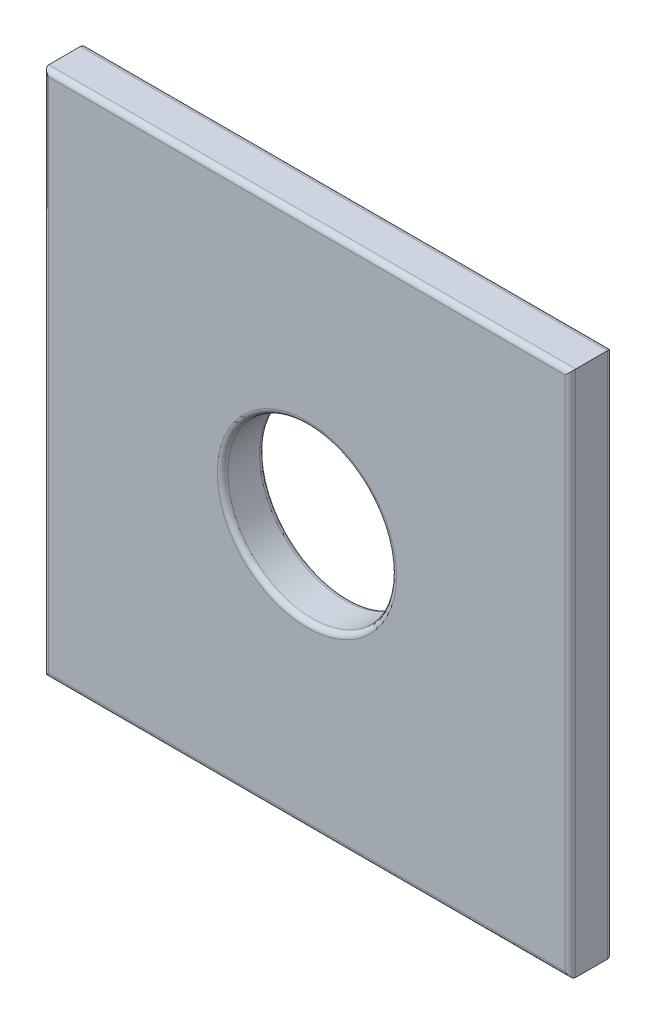
ISO-10303-21;
HEADER;
FILE_DESCRIPTION(('STEP AP214'),'2;1');
FILE_NAME('part.step','',(''),(''),'','','');
FILE_SCHEMA(('AUTOMOTIVE_DESIGN { 1 0 10303 214 1 1 1 1 }'));
ENDSEC;
DATA;
#1=APPLICATION_CONTEXT('core data for automotive mechanical design processes');
#2=APPLICATION_PROTOCOL_DEFINITION('international standard','automotive_design',2000,#1);
#3=PRODUCT_CONTEXT('',#1,'mechanical');
#4=PRODUCT('Part','Part','',(#3));
#5=PRODUCT_RELATED_PRODUCT_CATEGORY('part','',(#4));
#6=PRODUCT_DEFINITION_FORMATION('','',#4);
#7=PRODUCT_DEFINITION_CONTEXT('part definition',#1,'design');
#8=PRODUCT_DEFINITION('design','',#6,#7);
#9=PRODUCT_DEFINITION_SHAPE('','',#8);
#10=(LENGTH_UNIT() NAMED_UNIT(*) SI_UNIT(.MILLI.,.METRE.));
#11=(NAMED_UNIT(*) PLANE_ANGLE_UNIT() SI_UNIT($,.RADIAN.));
#12=(NAMED_UNIT(*) SI_UNIT($,.STERADIAN.) SOLID_ANGLE_UNIT());
#13=UNCERTAINTY_MEASURE_WITH_UNIT(LENGTH_MEASURE(1.E-05),#10,'distance_accuracy_value','');
#14=(GEOMETRIC_REPRESENTATION_CONTEXT(3) GLOBAL_UNCERTAINTY_ASSIGNED_CONTEXT((#13)) GLOBAL_UNIT_ASSIGNED_CONTEXT((#10,
#11,#12)) REPRESENTATION_CONTEXT('',''));
#15=CARTESIAN_POINT('',(0.,0.,0.));
#16=DIRECTION('',(0.,0.,1.));
#17=DIRECTION('',(1.,0.,0.));
#18=AXIS2_PLACEMENT_3D('',#15,#16,#17);
#19=CARTESIAN_POINT('',(-1005.55579576106,0.,4.));
#20=DIRECTION('',(1.,0.,0.));
#21=DIRECTION('',(0.,0.,-1.));
#22=AXIS2_PLACEMENT_3D('',#19,#20,#21);
#23=PLANE('',#22);
#24=DIRECTION('',(0.,0.,-1.));
#25=VECTOR('',#24,1.);
#26=CARTESIAN_POINT('',(-1005.55579576106,-175.582176963622,4.));
#27=LINE('',#26,#25);
#28=CARTESIAN_POINT('',(-1005.55579576106,-175.582176963622,3.5));
#29=VERTEX_POINT('',#28);
#30=CARTESIAN_POINT('',(-1005.55579576106,-175.582176963622,0.5));
#31=VERTEX_POINT('',#30);
#32=EDGE_CURVE('E154',#29,#31,#27,.T.);
#33=ORIENTED_EDGE('',*,*,#32,.T.);
#34=DIRECTION('',(0.,-1.,0.));
#35=VECTOR('',#34,1.);
#36=CARTESIAN_POINT('',(-1005.55579576106,-125.582176963622,0.5));
#37=LINE('',#36,#35);
#38=CARTESIAN_POINT('',(-1005.55579576106,-125.582176963622,0.5));
#39=VERTEX_POINT('',#38);
#40=EDGE_CURVE('E174',#31,#39,#37,.F.);
#41=ORIENTED_EDGE('',*,*,#40,.T.);
#42=DIRECTION('',(0.,0.,-1.));
#43=VECTOR('',#42,1.);
#44=CARTESIAN_POINT('',(-1005.55579576106,-125.582176963622,4.));
#45=LINE('',#44,#43);
#46=CARTESIAN_POINT('',(-1005.55579576106,-125.582176963622,3.5));
#47=VERTEX_POINT('',#46);
#48=EDGE_CURVE('E135',#47,#39,#45,.T.);
#49=ORIENTED_EDGE('',*,*,#48,.F.);
#50=DIRECTION('',(0.,-1.,0.));
#51=VECTOR('',#50,1.);
#52=CARTESIAN_POINT('',(-1005.55579576106,0.,3.5));
#53=LINE('',#52,#51);
#54=EDGE_CURVE('E176',#47,#29,#53,.T.);
#55=ORIENTED_EDGE('',*,*,#54,.T.);
#56=EDGE_LOOP('',(#33,#41,#49,#55));
#57=FACE_BOUND('',#56,.T.);
#58=ADVANCED_FACE('F47',(#57),#23,.T.);
#59=CARTESIAN_POINT('',(0.,-125.582176963622,4.));
#60=DIRECTION('',(0.,-1.,0.));
#61=DIRECTION('',(0.,0.,-1.));
#62=AXIS2_PLACEMENT_3D('',#59,#60,#61);
#63=PLANE('',#62);
#64=ORIENTED_EDGE('',*,*,#48,.T.);
#65=DIRECTION('',(-1.,0.,0.));
#66=VECTOR('',#65,1.);
#67=CARTESIAN_POINT('',(0.,-125.582176963622,0.5));
#68=LINE('',#67,#66);
#69=CARTESIAN_POINT('',(-1055.55579576106,-125.582176963622,0.5));
#70=VERTEX_POINT('',#69);
#71=EDGE_CURVE('E134',#39,#70,#68,.T.);
#72=ORIENTED_EDGE('',*,*,#71,.T.);
#73=DIRECTION('',(0.,0.,-1.));
#74=VECTOR('',#73,1.);
#75=CARTESIAN_POINT('',(-1055.55579576106,-125.582176963622,4.));
#76=LINE('',#75,#74);
#77=CARTESIAN_POINT('',(-1055.55579576106,-125.582176963622,3.5));
#78=VERTEX_POINT('',#77);
#79=EDGE_CURVE('E116',#78,#70,#76,.T.);
#80=ORIENTED_EDGE('',*,*,#79,.F.);
#81=DIRECTION('',(-1.,0.,0.));
#82=VECTOR('',#81,1.);
#83=CARTESIAN_POINT('',(-1005.55579576106,-125.582176963622,3.5));
#84=LINE('',#83,#82);
#85=EDGE_CURVE('E131',#78,#47,#84,.F.);
#86=ORIENTED_EDGE('',*,*,#85,.T.);
#87=EDGE_LOOP('',(#64,#72,#80,#86));
#88=FACE_BOUND('',#87,.T.);
#89=ADVANCED_FACE('F130',(#88),#63,.F.);
#90=CARTESIAN_POINT('',(-1055.55579576106,0.,4.));
#91=DIRECTION('',(1.,0.,0.));
#92=DIRECTION('',(0.,0.,-1.));
#93=AXIS2_PLACEMENT_3D('',#90,#91,#92);
#94=PLANE('',#93);
#95=ORIENTED_EDGE('',*,*,#79,.T.);
#96=DIRECTION('',(0.,-1.,0.));
#97=VECTOR('',#96,1.);
#98=CARTESIAN_POINT('',(-1055.55579576106,0.,0.5));
#99=LINE('',#98,#97);
#100=CARTESIAN_POINT('',(-1055.55579576106,-175.582176963622,0.5));
#101=VERTEX_POINT('',#100);
#102=EDGE_CURVE('E123',#70,#101,#99,.T.);
#103=ORIENTED_EDGE('',*,*,#102,.T.);
#104=DIRECTION('',(0.,0.,-1.));
#105=VECTOR('',#104,1.);
#106=CARTESIAN_POINT('',(-1055.55579576106,-175.582176963622,4.));
#107=LINE('',#106,#105);
#108=CARTESIAN_POINT('',(-1055.55579576106,-175.582176963622,3.5));
#109=VERTEX_POINT('',#108);
#110=EDGE_CURVE('E118',#109,#101,#107,.T.);
#111=ORIENTED_EDGE('',*,*,#110,.F.);
#112=DIRECTION('',(0.,-1.,0.));
#113=VECTOR('',#112,1.);
#114=CARTESIAN_POINT('',(-1055.55579576106,-125.582176963622,3.5));
#115=LINE('',#114,#113);
#116=EDGE_CURVE('E113',#109,#78,#115,.F.);
#117=ORIENTED_EDGE('',*,*,#116,.T.);
#118=EDGE_LOOP('',(#95,#103,#111,#117));
#119=FACE_BOUND('',#118,.T.);
#120=ADVANCED_FACE('F115',(#119),#94,.F.);
#121=CARTESIAN_POINT('',(-1030.55579576106,-150.582176963622,4.));
#122=DIRECTION('',(0.,0.,-1.));
#123=DIRECTION('',(-1.,0.,0.));
#124=AXIS2_PLACEMENT_3D('',#121,#122,#123);
#125=CYLINDRICAL_SURFACE('',#124,7.99999999999999);
#126=CARTESIAN_POINT('',(-1030.55579576106,-150.582176963622,0.5));
#127=DIRECTION('',(0.,0.,1.));
#128=DIRECTION('',(1.,0.,0.));
#129=AXIS2_PLACEMENT_3D('',#126,#127,#128);
#130=CIRCLE('',#129,7.99999999999999);
#131=CARTESIAN_POINT('',(-1022.55579576106,-150.582176963622,0.5));
#132=VERTEX_POINT('',#131);
#133=EDGE_CURVE('E168',#132,#132,#130,.F.);
#134=ORIENTED_EDGE('',*,*,#133,.T.);
#135=EDGE_LOOP('',(#134));
#136=FACE_BOUND('',#135,.T.);
#137=CARTESIAN_POINT('',(-1030.55579576106,-150.582176963622,3.5));
#138=DIRECTION('',(0.,0.,1.));
#139=DIRECTION('',(1.,0.,0.));
#140=AXIS2_PLACEMENT_3D('',#137,#138,#139);
#141=CIRCLE('',#140,7.99999999999999);
#142=CARTESIAN_POINT('',(-1022.55579576106,-150.582176963622,3.5));
#143=VERTEX_POINT('',#142);
#144=EDGE_CURVE('E171',#143,#143,#141,.T.);
#145=ORIENTED_EDGE('',*,*,#144,.T.);
#146=EDGE_LOOP('',(#145));
#147=FACE_BOUND('',#146,.T.);
#148=ADVANCED_FACE('F246',(#136,#147),#125,.F.);
#149=CARTESIAN_POINT('',(0.,-175.582176963622,4.));
#150=DIRECTION('',(0.,-1.,0.));
#151=DIRECTION('',(0.,0.,-1.));
#152=AXIS2_PLACEMENT_3D('',#149,#150,#151);
#153=PLANE('',#152);
#154=ORIENTED_EDGE('',*,*,#110,.T.);
#155=DIRECTION('',(-1.,0.,0.));
#156=VECTOR('',#155,1.);
#157=CARTESIAN_POINT('',(-1005.55579576106,-175.582176963622,0.5));
#158=LINE('',#157,#156);
#159=EDGE_CURVE('E178',#101,#31,#158,.F.);
#160=ORIENTED_EDGE('',*,*,#159,.T.);
#161=ORIENTED_EDGE('',*,*,#32,.F.);
#162=DIRECTION('',(-1.,0.,0.));
#163=VECTOR('',#162,1.);
#164=CARTESIAN_POINT('',(0.,-175.582176963622,3.5));
#165=LINE('',#164,#163);
#166=EDGE_CURVE('E180',#29,#109,#165,.T.);
#167=ORIENTED_EDGE('',*,*,#166,.T.);
#168=EDGE_LOOP('',(#154,#160,#161,#167));
#169=FACE_BOUND('',#168,.T.);
#170=ADVANCED_FACE('F221',(#169),#153,.T.);
#171=CARTESIAN_POINT('',(0.,0.,4.));
#172=DIRECTION('',(0.,0.,1.));
#173=DIRECTION('',(1.,0.,0.));
#174=AXIS2_PLACEMENT_3D('',#171,#172,#173);
#175=PLANE('',#174);
#176=DIRECTION('',(0.,-1.,0.));
#177=VECTOR('',#176,1.);
#178=CARTESIAN_POINT('',(-1055.05579576106,-175.582176963622,4.));
#179=LINE('',#178,#177);
#180=CARTESIAN_POINT('',(-1055.05579576106,-126.082176963622,4.));
#181=VERTEX_POINT('',#180);
#182=CARTESIAN_POINT('',(-1055.05579576106,-175.082176963622,4.));
#183=VERTEX_POINT('',#182);
#184=EDGE_CURVE('E56',#181,#183,#179,.T.);
#185=ORIENTED_EDGE('',*,*,#184,.T.);
#186=DIRECTION('',(-1.,0.,0.));
#187=VECTOR('',#186,1.);
#188=CARTESIAN_POINT('',(0.,-175.082176963622,4.));
#189=LINE('',#188,#187);
#190=CARTESIAN_POINT('',(-1006.05579576106,-175.082176963622,4.));
#191=VERTEX_POINT('',#190);
#192=EDGE_CURVE('E13',#183,#191,#189,.F.);
#193=ORIENTED_EDGE('',*,*,#192,.T.);
#194=DIRECTION('',(0.,-1.,0.));
#195=VECTOR('',#194,1.);
#196=CARTESIAN_POINT('',(-1006.05579576106,0.,4.));
#197=LINE('',#196,#195);
#198=CARTESIAN_POINT('',(-1006.05579576106,-126.082176963622,4.));
#199=VERTEX_POINT('',#198);
#200=EDGE_CURVE('E163',#191,#199,#197,.F.);
#201=ORIENTED_EDGE('',*,*,#200,.T.);
#202=DIRECTION('',(-1.,0.,0.));
#203=VECTOR('',#202,1.);
#204=CARTESIAN_POINT('',(-1055.55579576106,-126.082176963622,4.));
#205=LINE('',#204,#203);
#206=EDGE_CURVE('E67',#199,#181,#205,.T.);
#207=ORIENTED_EDGE('',*,*,#206,.T.);
#208=EDGE_LOOP('',(#185,#193,#201,#207));
#209=FACE_BOUND('',#208,.T.);
#210=CARTESIAN_POINT('',(-1030.55579576106,-150.582176963622,4.));
#211=DIRECTION('',(0.,0.,1.));
#212=DIRECTION('',(1.,0.,0.));
#213=AXIS2_PLACEMENT_3D('',#210,#211,#212);
#214=CIRCLE('',#213,8.49999999999999);
#215=CARTESIAN_POINT('',(-1022.05579576106,-150.582176963622,4.));
#216=VERTEX_POINT('',#215);
#217=EDGE_CURVE('E165',#216,#216,#214,.F.);
#218=ORIENTED_EDGE('',*,*,#217,.T.);
#219=EDGE_LOOP('',(#218));
#220=FACE_BOUND('',#219,.T.);
#221=ADVANCED_FACE('F226',(#209,#220),#175,.T.);
#222=CARTESIAN_POINT('',(0.,0.,0.));
#223=DIRECTION('',(0.,0.,1.));
#224=DIRECTION('',(1.,0.,0.));
#225=AXIS2_PLACEMENT_3D('',#222,#223,#224);
#226=PLANE('',#225);
#227=DIRECTION('',(0.,-1.,0.));
#228=VECTOR('',#227,1.);
#229=CARTESIAN_POINT('',(-1055.05579576106,0.,0.));
#230=LINE('',#229,#228);
#231=CARTESIAN_POINT('',(-1055.05579576106,-175.082176963622,0.));
#232=VERTEX_POINT('',#231);
#233=CARTESIAN_POINT('',(-1055.05579576106,-126.082176963622,0.));
#234=VERTEX_POINT('',#233);
#235=EDGE_CURVE('E185',#232,#234,#230,.F.);
#236=ORIENTED_EDGE('',*,*,#235,.T.);
#237=DIRECTION('',(-1.,0.,0.));
#238=VECTOR('',#237,1.);
#239=CARTESIAN_POINT('',(0.,-126.082176963622,0.));
#240=LINE('',#239,#238);
#241=CARTESIAN_POINT('',(-1006.05579576106,-126.082176963622,0.));
#242=VERTEX_POINT('',#241);
#243=EDGE_CURVE('E124',#234,#242,#240,.F.);
#244=ORIENTED_EDGE('',*,*,#243,.T.);
#245=DIRECTION('',(0.,-1.,0.));
#246=VECTOR('',#245,1.);
#247=CARTESIAN_POINT('',(-1006.05579576106,-175.582176963622,0.));
#248=LINE('',#247,#246);
#249=CARTESIAN_POINT('',(-1006.05579576106,-175.082176963622,0.));
#250=VERTEX_POINT('',#249);
#251=EDGE_CURVE('E189',#242,#250,#248,.T.);
#252=ORIENTED_EDGE('',*,*,#251,.T.);
#253=DIRECTION('',(-1.,0.,0.));
#254=VECTOR('',#253,1.);
#255=CARTESIAN_POINT('',(-1055.55579576106,-175.082176963622,0.));
#256=LINE('',#255,#254);
#257=EDGE_CURVE('E187',#250,#232,#256,.T.);
#258=ORIENTED_EDGE('',*,*,#257,.T.);
#259=EDGE_LOOP('',(#236,#244,#252,#258));
#260=FACE_BOUND('',#259,.T.);
#261=CARTESIAN_POINT('',(-1030.55579576106,-150.582176963622,0.));
#262=DIRECTION('',(0.,0.,1.));
#263=DIRECTION('',(1.,0.,0.));
#264=AXIS2_PLACEMENT_3D('',#261,#262,#263);
#265=CIRCLE('',#264,8.49999999999999);
#266=CARTESIAN_POINT('',(-1022.05579576106,-150.582176963622,0.));
#267=VERTEX_POINT('',#266);
#268=EDGE_CURVE('E191',#267,#267,#265,.T.);
#269=ORIENTED_EDGE('',*,*,#268,.T.);
#270=EDGE_LOOP('',(#269));
#271=FACE_BOUND('',#270,.T.);
#272=ADVANCED_FACE('F258',(#260,#271),#226,.F.);
#273=CARTESIAN_POINT('',(0.,-175.082176963622,0.5));
#274=DIRECTION('',(1.,0.,0.));
#275=DIRECTION('',(0.,0.,-1.));
#276=AXIS2_PLACEMENT_3D('',#273,#274,#275);
#277=CYLINDRICAL_SURFACE('',#276,0.5);
#278=CARTESIAN_POINT('',(-1055.05579576106,-175.082176963622,0.5));
#279=DIRECTION('',(0.707106781186547,-0.707106781186547,0.));
#280=DIRECTION('',(0.707106781186547,0.707106781186547,0.));
#281=AXIS2_PLACEMENT_3D('',#278,#279,#280);
#282=ELLIPSE('',#281,0.707106781186547,0.5);
#283=EDGE_CURVE('E155',#232,#101,#282,.F.);
#284=ORIENTED_EDGE('',*,*,#283,.F.);
#285=ORIENTED_EDGE('',*,*,#257,.F.);
#286=CARTESIAN_POINT('',(-1006.05579576106,-175.082176963622,0.5));
#287=DIRECTION('',(0.707106781186547,0.707106781186547,0.));
#288=DIRECTION('',(-0.707106781186547,0.707106781186547,0.));
#289=AXIS2_PLACEMENT_3D('',#286,#287,#288);
#290=ELLIPSE('',#289,0.707106781186547,0.5);
#291=EDGE_CURVE('E151',#31,#250,#290,.T.);
#292=ORIENTED_EDGE('',*,*,#291,.F.);
#293=ORIENTED_EDGE('',*,*,#159,.F.);
#294=EDGE_LOOP('',(#284,#285,#292,#293));
#295=FACE_BOUND('',#294,.T.);
#296=ADVANCED_FACE('F208',(#295),#277,.T.);
#297=CARTESIAN_POINT('',(-1006.05579576106,0.,0.5));
#298=DIRECTION('',(0.,1.,0.));
#299=DIRECTION('',(0.,0.,1.));
#300=AXIS2_PLACEMENT_3D('',#297,#298,#299);
#301=CYLINDRICAL_SURFACE('',#300,0.5);
#302=ORIENTED_EDGE('',*,*,#291,.T.);
#303=ORIENTED_EDGE('',*,*,#251,.F.);
#304=CARTESIAN_POINT('',(-1006.05579576106,-126.082176963622,0.5));
#305=DIRECTION('',(-0.707106781186547,0.707106781186547,0.));
#306=DIRECTION('',(0.707106781186547,0.707106781186547,0.));
#307=AXIS2_PLACEMENT_3D('',#304,#305,#306);
#308=ELLIPSE('',#307,0.707106781186547,0.5);
#309=EDGE_CURVE('E158',#39,#242,#308,.T.);
#310=ORIENTED_EDGE('',*,*,#309,.F.);
#311=ORIENTED_EDGE('',*,*,#40,.F.);
#312=EDGE_LOOP('',(#302,#303,#310,#311));
#313=FACE_BOUND('',#312,.T.);
#314=ADVANCED_FACE('F212',(#313),#301,.T.);
#315=CARTESIAN_POINT('',(-1055.05579576106,0.,0.5));
#316=DIRECTION('',(0.,-1.,0.));
#317=DIRECTION('',(0.,0.,-1.));
#318=AXIS2_PLACEMENT_3D('',#315,#316,#317);
#319=CYLINDRICAL_SURFACE('',#318,0.5);
#320=ORIENTED_EDGE('',*,*,#283,.T.);
#321=ORIENTED_EDGE('',*,*,#102,.F.);
#322=CARTESIAN_POINT('',(-1055.05579576106,-126.082176963622,0.5));
#323=DIRECTION('',(-0.707106781186547,-0.707106781186547,0.));
#324=DIRECTION('',(0.707106781186547,-0.707106781186547,0.));
#325=AXIS2_PLACEMENT_3D('',#322,#323,#324);
#326=ELLIPSE('',#325,0.707106781186547,0.5);
#327=EDGE_CURVE('E146',#234,#70,#326,.F.);
#328=ORIENTED_EDGE('',*,*,#327,.F.);
#329=ORIENTED_EDGE('',*,*,#235,.F.);
#330=EDGE_LOOP('',(#320,#321,#328,#329));
#331=FACE_BOUND('',#330,.T.);
#332=ADVANCED_FACE('F220',(#331),#319,.T.);
#333=CARTESIAN_POINT('',(0.,-126.082176963622,0.5));
#334=DIRECTION('',(-1.,0.,0.));
#335=DIRECTION('',(0.,0.,1.));
#336=AXIS2_PLACEMENT_3D('',#333,#334,#335);
#337=CYLINDRICAL_SURFACE('',#336,0.5);
#338=ORIENTED_EDGE('',*,*,#309,.T.);
#339=ORIENTED_EDGE('',*,*,#243,.F.);
#340=ORIENTED_EDGE('',*,*,#327,.T.);
#341=ORIENTED_EDGE('',*,*,#71,.F.);
#342=EDGE_LOOP('',(#338,#339,#340,#341));
#343=FACE_BOUND('',#342,.T.);
#344=ADVANCED_FACE('F215',(#343),#337,.T.);
#345=CARTESIAN_POINT('',(-1030.55579576106,-150.582176963622,0.5));
#346=DIRECTION('',(0.,0.,1.));
#347=DIRECTION('',(1.,0.,0.));
#348=AXIS2_PLACEMENT_3D('',#345,#346,#347);
#349=TOROIDAL_SURFACE('',#348,8.49999999999999,0.5);
#350=ORIENTED_EDGE('',*,*,#133,.F.);
#351=EDGE_LOOP('',(#350));
#352=FACE_BOUND('',#351,.T.);
#353=ORIENTED_EDGE('',*,*,#268,.F.);
#354=EDGE_LOOP('',(#353));
#355=FACE_BOUND('',#354,.T.);
#356=ADVANCED_FACE('F237',(#352,#355),#349,.T.);
#357=CARTESIAN_POINT('',(0.,-126.082176963622,3.5));
#358=DIRECTION('',(1.,0.,0.));
#359=DIRECTION('',(0.,0.,-1.));
#360=AXIS2_PLACEMENT_3D('',#357,#358,#359);
#361=CYLINDRICAL_SURFACE('',#360,0.5);
#362=CARTESIAN_POINT('',(-1055.05579576106,-126.082176963622,3.5));
#363=DIRECTION('',(0.707106781186547,0.707106781186547,0.));
#364=DIRECTION('',(0.707106781186547,-0.707106781186547,0.));
#365=AXIS2_PLACEMENT_3D('',#362,#363,#364);
#366=ELLIPSE('',#365,0.707106781186547,0.5);
#367=EDGE_CURVE('E140',#181,#78,#366,.F.);
#368=ORIENTED_EDGE('',*,*,#367,.F.);
#369=ORIENTED_EDGE('',*,*,#206,.F.);
#370=CARTESIAN_POINT('',(-1006.05579576106,-126.082176963622,3.5));
#371=DIRECTION('',(0.707106781186547,-0.707106781186547,0.));
#372=DIRECTION('',(-0.707106781186547,-0.707106781186547,0.));
#373=AXIS2_PLACEMENT_3D('',#370,#371,#372);
#374=ELLIPSE('',#373,0.707106781186547,0.5);
#375=EDGE_CURVE('E51',#47,#199,#374,.T.);
#376=ORIENTED_EDGE('',*,*,#375,.F.);
#377=ORIENTED_EDGE('',*,*,#85,.F.);
#378=EDGE_LOOP('',(#368,#369,#376,#377));
#379=FACE_BOUND('',#378,.T.);
#380=ADVANCED_FACE('F139',(#379),#361,.T.);
#381=CARTESIAN_POINT('',(-1006.05579576106,0.,3.5));
#382=DIRECTION('',(0.,-1.,0.));
#383=DIRECTION('',(0.,0.,-1.));
#384=AXIS2_PLACEMENT_3D('',#381,#382,#383);
#385=CYLINDRICAL_SURFACE('',#384,0.5);
#386=ORIENTED_EDGE('',*,*,#375,.T.);
#387=ORIENTED_EDGE('',*,*,#200,.F.);
#388=CARTESIAN_POINT('',(-1006.05579576106,-175.082176963622,3.5));
#389=DIRECTION('',(-0.707106781186547,-0.707106781186547,0.));
#390=DIRECTION('',(0.707106781186547,-0.707106781186547,0.));
#391=AXIS2_PLACEMENT_3D('',#388,#389,#390);
#392=ELLIPSE('',#391,0.707106781186547,0.5);
#393=EDGE_CURVE('E145',#29,#191,#392,.T.);
#394=ORIENTED_EDGE('',*,*,#393,.F.);
#395=ORIENTED_EDGE('',*,*,#54,.F.);
#396=EDGE_LOOP('',(#386,#387,#394,#395));
#397=FACE_BOUND('',#396,.T.);
#398=ADVANCED_FACE('F229',(#397),#385,.T.);
#399=CARTESIAN_POINT('',(-1055.05579576106,0.,3.5));
#400=DIRECTION('',(0.,1.,0.));
#401=DIRECTION('',(0.,0.,1.));
#402=AXIS2_PLACEMENT_3D('',#399,#400,#401);
#403=CYLINDRICAL_SURFACE('',#402,0.5);
#404=ORIENTED_EDGE('',*,*,#367,.T.);
#405=ORIENTED_EDGE('',*,*,#116,.F.);
#406=CARTESIAN_POINT('',(-1055.05579576106,-175.082176963622,3.5));
#407=DIRECTION('',(-0.707106781186547,0.707106781186547,0.));
#408=DIRECTION('',(0.707106781186547,0.707106781186547,0.));
#409=AXIS2_PLACEMENT_3D('',#406,#407,#408);
#410=ELLIPSE('',#409,0.707106781186547,0.5);
#411=EDGE_CURVE('E147',#183,#109,#410,.F.);
#412=ORIENTED_EDGE('',*,*,#411,.F.);
#413=ORIENTED_EDGE('',*,*,#184,.F.);
#414=EDGE_LOOP('',(#404,#405,#412,#413));
#415=FACE_BOUND('',#414,.T.);
#416=ADVANCED_FACE('F144',(#415),#403,.T.);
#417=CARTESIAN_POINT('',(0.,-175.082176963622,3.5));
#418=DIRECTION('',(-1.,0.,0.));
#419=DIRECTION('',(0.,0.,1.));
#420=AXIS2_PLACEMENT_3D('',#417,#418,#419);
#421=CYLINDRICAL_SURFACE('',#420,0.5);
#422=ORIENTED_EDGE('',*,*,#393,.T.);
#423=ORIENTED_EDGE('',*,*,#192,.F.);
#424=ORIENTED_EDGE('',*,*,#411,.T.);
#425=ORIENTED_EDGE('',*,*,#166,.F.);
#426=EDGE_LOOP('',(#422,#423,#424,#425));
#427=FACE_BOUND('',#426,.T.);
#428=ADVANCED_FACE('F224',(#427),#421,.T.);
#429=CARTESIAN_POINT('',(-1030.55579576106,-150.582176963622,3.5));
#430=DIRECTION('',(0.,0.,1.));
#431=DIRECTION('',(1.,0.,0.));
#432=AXIS2_PLACEMENT_3D('',#429,#430,#431);
#433=TOROIDAL_SURFACE('',#432,8.49999999999999,0.5);
#434=ORIENTED_EDGE('',*,*,#217,.F.);
#435=EDGE_LOOP('',(#434));
#436=FACE_BOUND('',#435,.T.);
#437=ORIENTED_EDGE('',*,*,#144,.F.);
#438=EDGE_LOOP('',(#437));
#439=FACE_BOUND('',#438,.T.);
#440=ADVANCED_FACE('F49',(#436,#439),#433,.T.);
#441=CLOSED_SHELL('',(#58,#89,#120,#148,#170,#221,#272,#296,#314,#332,#344,#356,#380,#398,#416,
#428,#440));
#442=MANIFOLD_SOLID_BREP('B2',#441);
#443=ADVANCED_BREP_SHAPE_REPRESENTATION('',(#18,#442),#14);
#444=SHAPE_DEFINITION_REPRESENTATION(#9,#443);
ENDSEC;
END-ISO-10303-21;
